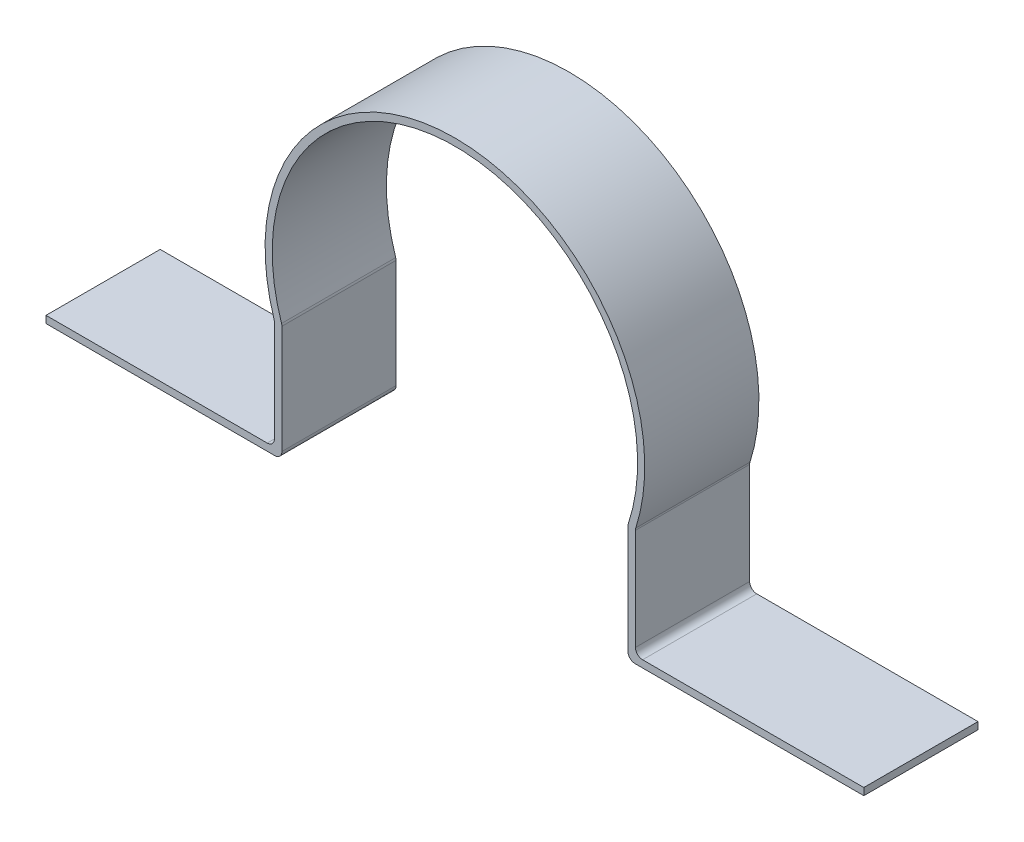
ISO-10303-21;
HEADER;
FILE_DESCRIPTION(('STEP AP214'),'2;1');
FILE_NAME('part.step','',(''),(''),'','','');
FILE_SCHEMA(('AUTOMOTIVE_DESIGN { 1 0 10303 214 1 1 1 1 }'));
ENDSEC;
DATA;
#1=APPLICATION_CONTEXT('core data for automotive mechanical design processes');
#2=APPLICATION_PROTOCOL_DEFINITION('international standard','automotive_design',2000,#1);
#3=PRODUCT_CONTEXT('',#1,'mechanical');
#4=PRODUCT('Part','Part','',(#3));
#5=PRODUCT_RELATED_PRODUCT_CATEGORY('part','',(#4));
#6=PRODUCT_DEFINITION_FORMATION('','',#4);
#7=PRODUCT_DEFINITION_CONTEXT('part definition',#1,'design');
#8=PRODUCT_DEFINITION('design','',#6,#7);
#9=PRODUCT_DEFINITION_SHAPE('','',#8);
#10=(LENGTH_UNIT() NAMED_UNIT(*) SI_UNIT(.MILLI.,.METRE.));
#11=(NAMED_UNIT(*) PLANE_ANGLE_UNIT() SI_UNIT($,.RADIAN.));
#12=(NAMED_UNIT(*) SI_UNIT($,.STERADIAN.) SOLID_ANGLE_UNIT());
#13=UNCERTAINTY_MEASURE_WITH_UNIT(LENGTH_MEASURE(1.E-05),#10,'distance_accuracy_value','');
#14=(GEOMETRIC_REPRESENTATION_CONTEXT(3) GLOBAL_UNCERTAINTY_ASSIGNED_CONTEXT((#13)) GLOBAL_UNIT_ASSIGNED_CONTEXT((#10,
#11,#12)) REPRESENTATION_CONTEXT('',''));
#15=CARTESIAN_POINT('',(0.,0.,0.));
#16=DIRECTION('',(0.,0.,1.));
#17=DIRECTION('',(1.,0.,0.));
#18=AXIS2_PLACEMENT_3D('',#15,#16,#17);
#19=CARTESIAN_POINT('',(20.0804314021882,0.,12.7));
#20=DIRECTION('',(1.,0.,0.));
#21=DIRECTION('',(0.,1.,0.));
#22=AXIS2_PLACEMENT_3D('',#19,#20,#21);
#23=PLANE('',#22);
#24=DIRECTION('',(0.,-1.,0.));
#25=VECTOR('',#24,1.);
#26=CARTESIAN_POINT('',(20.0804314021882,0.,0.));
#27=LINE('',#26,#25);
#28=CARTESIAN_POINT('',(20.0804314021882,-6.64884253374514,0.));
#29=VERTEX_POINT('',#28);
#30=CARTESIAN_POINT('',(20.0804314021883,-17.9225671109713,0.));
#31=VERTEX_POINT('',#30);
#32=EDGE_CURVE('E223',#29,#31,#27,.T.);
#33=ORIENTED_EDGE('',*,*,#32,.F.);
#34=DIRECTION('',(0.,0.,-1.));
#35=VECTOR('',#34,1.);
#36=CARTESIAN_POINT('',(20.0804314021882,-6.64884253374514,12.7));
#37=LINE('',#36,#35);
#38=CARTESIAN_POINT('',(20.0804314021882,-6.64884253374514,12.7));
#39=VERTEX_POINT('',#38);
#40=EDGE_CURVE('E292',#29,#39,#37,.F.);
#41=ORIENTED_EDGE('',*,*,#40,.T.);
#42=DIRECTION('',(0.,-1.,0.));
#43=VECTOR('',#42,1.);
#44=CARTESIAN_POINT('',(20.0804314021882,0.,12.7));
#45=LINE('',#44,#43);
#46=CARTESIAN_POINT('',(20.0804314021883,-17.9225671109713,12.7));
#47=VERTEX_POINT('',#46);
#48=EDGE_CURVE('E253',#39,#47,#45,.T.);
#49=ORIENTED_EDGE('',*,*,#48,.T.);
#50=DIRECTION('',(0.,0.,-1.));
#51=VECTOR('',#50,1.);
#52=CARTESIAN_POINT('',(20.0804314021883,-17.9225671109713,0.));
#53=LINE('',#52,#51);
#54=EDGE_CURVE('E289',#47,#31,#53,.T.);
#55=ORIENTED_EDGE('',*,*,#54,.T.);
#56=EDGE_LOOP('',(#33,#41,#49,#55));
#57=FACE_BOUND('',#56,.T.);
#58=ADVANCED_FACE('F37',(#57),#23,.T.);
#59=CARTESIAN_POINT('',(0.,0.,12.7));
#60=DIRECTION('',(0.,0.,-1.));
#61=DIRECTION('',(-1.,0.,0.));
#62=AXIS2_PLACEMENT_3D('',#59,#60,#61);
#63=CYLINDRICAL_SURFACE('',#62,21.11375);
#64=CARTESIAN_POINT('',(0.,0.,12.7));
#65=DIRECTION('',(0.,0.,1.));
#66=DIRECTION('',(1.,0.,0.));
#67=AXIS2_PLACEMENT_3D('',#64,#65,#66);
#68=CIRCLE('',#67,21.11375);
#69=CARTESIAN_POINT('',(20.1178704818191,-6.40794244194278,12.7));
#70=VERTEX_POINT('',#69);
#71=CARTESIAN_POINT('',(-20.1178704818191,-6.40794244194278,12.7));
#72=VERTEX_POINT('',#71);
#73=EDGE_CURVE('E411',#70,#72,#68,.T.);
#74=ORIENTED_EDGE('',*,*,#73,.F.);
#75=DIRECTION('',(0.,0.,-1.));
#76=VECTOR('',#75,1.);
#77=CARTESIAN_POINT('',(20.1178704818191,-6.40794244194278,12.7));
#78=LINE('',#77,#76);
#79=CARTESIAN_POINT('',(20.1178704818191,-6.40794244194278,0.));
#80=VERTEX_POINT('',#79);
#81=EDGE_CURVE('E286',#70,#80,#78,.T.);
#82=ORIENTED_EDGE('',*,*,#81,.T.);
#83=CARTESIAN_POINT('',(0.,0.,0.));
#84=DIRECTION('',(0.,0.,1.));
#85=DIRECTION('',(1.,0.,0.));
#86=AXIS2_PLACEMENT_3D('',#83,#84,#85);
#87=CIRCLE('',#86,21.11375);
#88=CARTESIAN_POINT('',(-20.1178704818191,-6.40794244194278,0.));
#89=VERTEX_POINT('',#88);
#90=EDGE_CURVE('E226',#80,#89,#87,.T.);
#91=ORIENTED_EDGE('',*,*,#90,.T.);
#92=DIRECTION('',(0.,0.,-1.));
#93=VECTOR('',#92,1.);
#94=CARTESIAN_POINT('',(-20.1178704818191,-6.40794244194278,12.7));
#95=LINE('',#94,#93);
#96=EDGE_CURVE('E284',#89,#72,#95,.F.);
#97=ORIENTED_EDGE('',*,*,#96,.T.);
#98=EDGE_LOOP('',(#74,#82,#91,#97));
#99=FACE_BOUND('',#98,.T.);
#100=ADVANCED_FACE('F341',(#99),#63,.T.);
#101=CARTESIAN_POINT('',(-20.0804314021882,0.,12.7));
#102=DIRECTION('',(1.,0.,0.));
#103=DIRECTION('',(0.,0.,-1.));
#104=AXIS2_PLACEMENT_3D('',#101,#102,#103);
#105=PLANE('',#104);
#106=DIRECTION('',(0.,-1.,0.));
#107=VECTOR('',#106,1.);
#108=CARTESIAN_POINT('',(-20.0804314021882,0.,12.7));
#109=LINE('',#108,#107);
#110=CARTESIAN_POINT('',(-20.0804314021882,-6.64884253374514,12.7));
#111=VERTEX_POINT('',#110);
#112=CARTESIAN_POINT('',(-20.0804314021882,-17.9225671109713,12.7));
#113=VERTEX_POINT('',#112);
#114=EDGE_CURVE('E186',#111,#113,#109,.T.);
#115=ORIENTED_EDGE('',*,*,#114,.F.);
#116=DIRECTION('',(0.,0.,1.));
#117=VECTOR('',#116,1.);
#118=CARTESIAN_POINT('',(-20.0804314021882,-6.64884253374514,0.));
#119=LINE('',#118,#117);
#120=CARTESIAN_POINT('',(-20.0804314021882,-6.64884253374514,0.));
#121=VERTEX_POINT('',#120);
#122=EDGE_CURVE('E307',#111,#121,#119,.F.);
#123=ORIENTED_EDGE('',*,*,#122,.T.);
#124=DIRECTION('',(0.,-1.,0.));
#125=VECTOR('',#124,1.);
#126=CARTESIAN_POINT('',(-20.0804314021882,0.,0.));
#127=LINE('',#126,#125);
#128=CARTESIAN_POINT('',(-20.0804314021882,-17.9225671109713,0.));
#129=VERTEX_POINT('',#128);
#130=EDGE_CURVE('E229',#121,#129,#127,.T.);
#131=ORIENTED_EDGE('',*,*,#130,.T.);
#132=DIRECTION('',(0.,0.,-1.));
#133=VECTOR('',#132,1.);
#134=CARTESIAN_POINT('',(-20.0804314021882,-17.9225671109713,12.7));
#135=LINE('',#134,#133);
#136=EDGE_CURVE('E305',#129,#113,#135,.F.);
#137=ORIENTED_EDGE('',*,*,#136,.T.);
#138=EDGE_LOOP('',(#115,#123,#131,#137));
#139=FACE_BOUND('',#138,.T.);
#140=ADVANCED_FACE('F331',(#139),#105,.F.);
#141=CARTESIAN_POINT('',(0.,-18.7163171109713,12.7));
#142=DIRECTION('',(0.,-1.,0.));
#143=DIRECTION('',(0.,0.,-1.));
#144=AXIS2_PLACEMENT_3D('',#141,#142,#143);
#145=PLANE('',#144);
#146=DIRECTION('',(-1.,0.,0.));
#147=VECTOR('',#146,1.);
#148=CARTESIAN_POINT('',(0.,-18.7163171109713,12.7));
#149=LINE('',#148,#147);
#150=CARTESIAN_POINT('',(-20.8741814021882,-18.7163171109713,12.7));
#151=VERTEX_POINT('',#150);
#152=CARTESIAN_POINT('',(-45.4804314021882,-18.7163171109713,12.7));
#153=VERTEX_POINT('',#152);
#154=EDGE_CURVE('E174',#151,#153,#149,.T.);
#155=ORIENTED_EDGE('',*,*,#154,.F.);
#156=DIRECTION('',(0.,0.,-1.));
#157=VECTOR('',#156,1.);
#158=CARTESIAN_POINT('',(-20.8741814021882,-18.7163171109713,0.));
#159=LINE('',#158,#157);
#160=CARTESIAN_POINT('',(-20.8741814021882,-18.7163171109713,0.));
#161=VERTEX_POINT('',#160);
#162=EDGE_CURVE('E310',#151,#161,#159,.T.);
#163=ORIENTED_EDGE('',*,*,#162,.T.);
#164=DIRECTION('',(-1.,0.,0.));
#165=VECTOR('',#164,1.);
#166=CARTESIAN_POINT('',(0.,-18.7163171109713,0.));
#167=LINE('',#166,#165);
#168=CARTESIAN_POINT('',(-45.4804314021882,-18.7163171109713,0.));
#169=VERTEX_POINT('',#168);
#170=EDGE_CURVE('E192',#161,#169,#167,.T.);
#171=ORIENTED_EDGE('',*,*,#170,.T.);
#172=DIRECTION('',(0.,0.,-1.));
#173=VECTOR('',#172,1.);
#174=CARTESIAN_POINT('',(-45.4804314021882,-18.7163171109713,12.7));
#175=LINE('',#174,#173);
#176=EDGE_CURVE('E189',#153,#169,#175,.T.);
#177=ORIENTED_EDGE('',*,*,#176,.F.);
#178=EDGE_LOOP('',(#155,#163,#171,#177));
#179=FACE_BOUND('',#178,.T.);
#180=ADVANCED_FACE('F190',(#179),#145,.F.);
#181=CARTESIAN_POINT('',(-45.4804314021884,-3.9758600088657E-13,12.7));
#182=DIRECTION('',(-1.,0.,0.));
#183=DIRECTION('',(0.,-1.,0.));
#184=AXIS2_PLACEMENT_3D('',#181,#182,#183);
#185=PLANE('',#184);
#186=DIRECTION('',(0.,1.,0.));
#187=VECTOR('',#186,1.);
#188=CARTESIAN_POINT('',(-45.4804314021884,-3.9758600088657E-13,0.));
#189=LINE('',#188,#187);
#190=CARTESIAN_POINT('',(-45.4804314021882,-19.5100671109713,0.));
#191=VERTEX_POINT('',#190);
#192=EDGE_CURVE('E233',#191,#169,#189,.T.);
#193=ORIENTED_EDGE('',*,*,#192,.F.);
#194=DIRECTION('',(0.,0.,-1.));
#195=VECTOR('',#194,1.);
#196=CARTESIAN_POINT('',(-45.4804314021882,-19.5100671109713,12.7));
#197=LINE('',#196,#195);
#198=CARTESIAN_POINT('',(-45.4804314021882,-19.5100671109713,12.7));
#199=VERTEX_POINT('',#198);
#200=EDGE_CURVE('E197',#199,#191,#197,.T.);
#201=ORIENTED_EDGE('',*,*,#200,.F.);
#202=DIRECTION('',(0.,1.,0.));
#203=VECTOR('',#202,1.);
#204=CARTESIAN_POINT('',(-45.4804314021884,-3.9758600088657E-13,12.7));
#205=LINE('',#204,#203);
#206=EDGE_CURVE('E180',#199,#153,#205,.T.);
#207=ORIENTED_EDGE('',*,*,#206,.T.);
#208=ORIENTED_EDGE('',*,*,#176,.T.);
#209=EDGE_LOOP('',(#193,#201,#207,#208));
#210=FACE_BOUND('',#209,.T.);
#211=ADVANCED_FACE('F200',(#210),#185,.T.);
#212=CARTESIAN_POINT('',(0.,-19.5100671109713,12.7));
#213=DIRECTION('',(0.,-1.,0.));
#214=DIRECTION('',(1.,0.,0.));
#215=AXIS2_PLACEMENT_3D('',#212,#213,#214);
#216=PLANE('',#215);
#217=DIRECTION('',(-1.,0.,0.));
#218=VECTOR('',#217,1.);
#219=CARTESIAN_POINT('',(0.,-19.5100671109713,0.));
#220=LINE('',#219,#218);
#221=CARTESIAN_POINT('',(-20.0378578316322,-19.5100671109713,0.));
#222=VERTEX_POINT('',#221);
#223=EDGE_CURVE('E235',#222,#191,#220,.T.);
#224=ORIENTED_EDGE('',*,*,#223,.F.);
#225=DIRECTION('',(0.,0.,-1.));
#226=VECTOR('',#225,1.);
#227=CARTESIAN_POINT('',(-20.0378578316322,-19.5100671109713,12.7));
#228=LINE('',#227,#226);
#229=CARTESIAN_POINT('',(-20.0378578316322,-19.5100671109713,12.7));
#230=VERTEX_POINT('',#229);
#231=EDGE_CURVE('E303',#222,#230,#228,.F.);
#232=ORIENTED_EDGE('',*,*,#231,.T.);
#233=DIRECTION('',(-1.,0.,0.));
#234=VECTOR('',#233,1.);
#235=CARTESIAN_POINT('',(0.,-19.5100671109713,12.7));
#236=LINE('',#235,#234);
#237=EDGE_CURVE('E202',#230,#199,#236,.T.);
#238=ORIENTED_EDGE('',*,*,#237,.T.);
#239=ORIENTED_EDGE('',*,*,#200,.T.);
#240=EDGE_LOOP('',(#224,#232,#238,#239));
#241=FACE_BOUND('',#240,.T.);
#242=ADVANCED_FACE('F435',(#241),#216,.T.);
#243=CARTESIAN_POINT('',(-19.2441078316322,0.,12.7));
#244=DIRECTION('',(1.,0.,0.));
#245=DIRECTION('',(0.,0.,-1.));
#246=AXIS2_PLACEMENT_3D('',#243,#244,#245);
#247=PLANE('',#246);
#248=DIRECTION('',(0.,-1.,0.));
#249=VECTOR('',#248,1.);
#250=CARTESIAN_POINT('',(-19.2441078316322,0.,12.7));
#251=LINE('',#250,#249);
#252=CARTESIAN_POINT('',(-19.2441078316322,-6.6539230970756,12.7));
#253=VERTEX_POINT('',#252);
#254=CARTESIAN_POINT('',(-19.2441078316322,-18.7163171109713,12.7));
#255=VERTEX_POINT('',#254);
#256=EDGE_CURVE('E204',#253,#255,#251,.T.);
#257=ORIENTED_EDGE('',*,*,#256,.T.);
#258=DIRECTION('',(0.,0.,-1.));
#259=VECTOR('',#258,1.);
#260=CARTESIAN_POINT('',(-19.2441078316322,-18.7163171109713,12.7));
#261=LINE('',#260,#259);
#262=CARTESIAN_POINT('',(-19.2441078316322,-18.7163171109713,0.));
#263=VERTEX_POINT('',#262);
#264=EDGE_CURVE('E300',#255,#263,#261,.T.);
#265=ORIENTED_EDGE('',*,*,#264,.T.);
#266=DIRECTION('',(0.,-1.,0.));
#267=VECTOR('',#266,1.);
#268=CARTESIAN_POINT('',(-19.2441078316322,0.,0.));
#269=LINE('',#268,#267);
#270=CARTESIAN_POINT('',(-19.2441078316322,-6.6539230970756,0.));
#271=VERTEX_POINT('',#270);
#272=EDGE_CURVE('E237',#271,#263,#269,.T.);
#273=ORIENTED_EDGE('',*,*,#272,.F.);
#274=DIRECTION('',(0.,0.,-1.));
#275=VECTOR('',#274,1.);
#276=CARTESIAN_POINT('',(-19.2441078316322,-6.6539230970756,12.7));
#277=LINE('',#276,#275);
#278=EDGE_CURVE('E298',#271,#253,#277,.F.);
#279=ORIENTED_EDGE('',*,*,#278,.T.);
#280=EDGE_LOOP('',(#257,#265,#273,#279));
#281=FACE_BOUND('',#280,.T.);
#282=ADVANCED_FACE('F432',(#281),#247,.T.);
#283=CARTESIAN_POINT('',(0.,0.,12.7));
#284=DIRECTION('',(0.,0.,-1.));
#285=DIRECTION('',(-1.,0.,0.));
#286=AXIS2_PLACEMENT_3D('',#283,#284,#285);
#287=CYLINDRICAL_SURFACE('',#286,20.32);
#288=CARTESIAN_POINT('',(0.,0.,0.));
#289=DIRECTION('',(0.,0.,1.));
#290=DIRECTION('',(1.,0.,0.));
#291=AXIS2_PLACEMENT_3D('',#288,#289,#290);
#292=CIRCLE('',#291,20.32);
#293=CARTESIAN_POINT('',(19.284554905631,-6.40377561222313,0.));
#294=VERTEX_POINT('',#293);
#295=CARTESIAN_POINT('',(-19.284554905631,-6.40377561222313,0.));
#296=VERTEX_POINT('',#295);
#297=EDGE_CURVE('E240',#294,#296,#292,.T.);
#298=ORIENTED_EDGE('',*,*,#297,.F.);
#299=DIRECTION('',(0.,0.,-1.));
#300=VECTOR('',#299,1.);
#301=CARTESIAN_POINT('',(19.284554905631,-6.40377561222313,12.7));
#302=LINE('',#301,#300);
#303=CARTESIAN_POINT('',(19.284554905631,-6.40377561222313,12.7));
#304=VERTEX_POINT('',#303);
#305=EDGE_CURVE('E275',#294,#304,#302,.F.);
#306=ORIENTED_EDGE('',*,*,#305,.T.);
#307=CARTESIAN_POINT('',(0.,0.,12.7));
#308=DIRECTION('',(0.,0.,1.));
#309=DIRECTION('',(1.,0.,0.));
#310=AXIS2_PLACEMENT_3D('',#307,#308,#309);
#311=CIRCLE('',#310,20.32);
#312=CARTESIAN_POINT('',(-19.284554905631,-6.40377561222313,12.7));
#313=VERTEX_POINT('',#312);
#314=EDGE_CURVE('E210',#304,#313,#311,.T.);
#315=ORIENTED_EDGE('',*,*,#314,.T.);
#316=DIRECTION('',(0.,0.,-1.));
#317=VECTOR('',#316,1.);
#318=CARTESIAN_POINT('',(-19.284554905631,-6.40377561222314,12.7));
#319=LINE('',#318,#317);
#320=EDGE_CURVE('E272',#313,#296,#319,.T.);
#321=ORIENTED_EDGE('',*,*,#320,.T.);
#322=EDGE_LOOP('',(#298,#306,#315,#321));
#323=FACE_BOUND('',#322,.T.);
#324=ADVANCED_FACE('F383',(#323),#287,.F.);
#325=CARTESIAN_POINT('',(19.2441078316322,0.,12.7));
#326=DIRECTION('',(1.,0.,0.));
#327=DIRECTION('',(0.,1.,0.));
#328=AXIS2_PLACEMENT_3D('',#325,#326,#327);
#329=PLANE('',#328);
#330=DIRECTION('',(0.,-1.,0.));
#331=VECTOR('',#330,1.);
#332=CARTESIAN_POINT('',(19.2441078316322,0.,12.7));
#333=LINE('',#332,#331);
#334=CARTESIAN_POINT('',(19.2441078316322,-6.6539230970756,12.7));
#335=VERTEX_POINT('',#334);
#336=CARTESIAN_POINT('',(19.2441078316322,-18.7163171109713,12.7));
#337=VERTEX_POINT('',#336);
#338=EDGE_CURVE('E213',#335,#337,#333,.T.);
#339=ORIENTED_EDGE('',*,*,#338,.F.);
#340=DIRECTION('',(0.,0.,1.));
#341=VECTOR('',#340,1.);
#342=CARTESIAN_POINT('',(19.2441078316322,-6.6539230970756,0.));
#343=LINE('',#342,#341);
#344=CARTESIAN_POINT('',(19.2441078316322,-6.6539230970756,0.));
#345=VERTEX_POINT('',#344);
#346=EDGE_CURVE('E261',#335,#345,#343,.F.);
#347=ORIENTED_EDGE('',*,*,#346,.T.);
#348=DIRECTION('',(0.,-1.,0.));
#349=VECTOR('',#348,1.);
#350=CARTESIAN_POINT('',(19.2441078316322,0.,0.));
#351=LINE('',#350,#349);
#352=CARTESIAN_POINT('',(19.2441078316322,-18.7163171109713,0.));
#353=VERTEX_POINT('',#352);
#354=EDGE_CURVE('E243',#345,#353,#351,.T.);
#355=ORIENTED_EDGE('',*,*,#354,.T.);
#356=DIRECTION('',(0.,0.,-1.));
#357=VECTOR('',#356,1.);
#358=CARTESIAN_POINT('',(19.2441078316322,-18.7163171109713,12.7));
#359=LINE('',#358,#357);
#360=EDGE_CURVE('E196',#353,#337,#359,.F.);
#361=ORIENTED_EDGE('',*,*,#360,.T.);
#362=EDGE_LOOP('',(#339,#347,#355,#361));
#363=FACE_BOUND('',#362,.T.);
#364=ADVANCED_FACE('F388',(#363),#329,.F.);
#365=CARTESIAN_POINT('',(0.,-19.5100671109713,12.7));
#366=DIRECTION('',(0.,1.,0.));
#367=DIRECTION('',(-1.,0.,0.));
#368=AXIS2_PLACEMENT_3D('',#365,#366,#367);
#369=PLANE('',#368);
#370=DIRECTION('',(1.,0.,0.));
#371=VECTOR('',#370,1.);
#372=CARTESIAN_POINT('',(0.,-19.5100671109713,12.7));
#373=LINE('',#372,#371);
#374=CARTESIAN_POINT('',(20.0378578316322,-19.5100671109713,12.7));
#375=VERTEX_POINT('',#374);
#376=CARTESIAN_POINT('',(45.4804314021883,-19.5100671109712,12.7));
#377=VERTEX_POINT('',#376);
#378=EDGE_CURVE('E215',#375,#377,#373,.T.);
#379=ORIENTED_EDGE('',*,*,#378,.F.);
#380=DIRECTION('',(0.,0.,-1.));
#381=VECTOR('',#380,1.);
#382=CARTESIAN_POINT('',(20.0378578316322,-19.5100671109713,12.7));
#383=LINE('',#382,#381);
#384=CARTESIAN_POINT('',(20.0378578316322,-19.5100671109713,0.));
#385=VERTEX_POINT('',#384);
#386=EDGE_CURVE('E295',#375,#385,#383,.T.);
#387=ORIENTED_EDGE('',*,*,#386,.T.);
#388=DIRECTION('',(1.,0.,0.));
#389=VECTOR('',#388,1.);
#390=CARTESIAN_POINT('',(0.,-19.5100671109713,0.));
#391=LINE('',#390,#389);
#392=CARTESIAN_POINT('',(45.4804314021883,-19.5100671109712,0.));
#393=VERTEX_POINT('',#392);
#394=EDGE_CURVE('E246',#385,#393,#391,.T.);
#395=ORIENTED_EDGE('',*,*,#394,.T.);
#396=DIRECTION('',(0.,0.,-1.));
#397=VECTOR('',#396,1.);
#398=CARTESIAN_POINT('',(45.4804314021883,-19.5100671109712,12.7));
#399=LINE('',#398,#397);
#400=EDGE_CURVE('E256',#377,#393,#399,.T.);
#401=ORIENTED_EDGE('',*,*,#400,.F.);
#402=EDGE_LOOP('',(#379,#387,#395,#401));
#403=FACE_BOUND('',#402,.T.);
#404=ADVANCED_FACE('F393',(#403),#369,.F.);
#405=CARTESIAN_POINT('',(45.4804314021884,-3.9758600088657E-13,12.7));
#406=DIRECTION('',(-1.,0.,0.));
#407=DIRECTION('',(0.,-1.,0.));
#408=AXIS2_PLACEMENT_3D('',#405,#406,#407);
#409=PLANE('',#408);
#410=DIRECTION('',(0.,1.,0.));
#411=VECTOR('',#410,1.);
#412=CARTESIAN_POINT('',(45.4804314021884,-3.9758600088657E-13,0.));
#413=LINE('',#412,#411);
#414=CARTESIAN_POINT('',(45.4804314021883,-18.7163171109712,0.));
#415=VERTEX_POINT('',#414);
#416=EDGE_CURVE('E248',#393,#415,#413,.T.);
#417=ORIENTED_EDGE('',*,*,#416,.T.);
#418=DIRECTION('',(0.,0.,-1.));
#419=VECTOR('',#418,1.);
#420=CARTESIAN_POINT('',(45.4804314021883,-18.7163171109712,12.7));
#421=LINE('',#420,#419);
#422=CARTESIAN_POINT('',(45.4804314021883,-18.7163171109712,12.7));
#423=VERTEX_POINT('',#422);
#424=EDGE_CURVE('E222',#423,#415,#421,.T.);
#425=ORIENTED_EDGE('',*,*,#424,.F.);
#426=DIRECTION('',(0.,1.,0.));
#427=VECTOR('',#426,1.);
#428=CARTESIAN_POINT('',(45.4804314021884,-3.9758600088657E-13,12.7));
#429=LINE('',#428,#427);
#430=EDGE_CURVE('E217',#377,#423,#429,.T.);
#431=ORIENTED_EDGE('',*,*,#430,.F.);
#432=ORIENTED_EDGE('',*,*,#400,.T.);
#433=EDGE_LOOP('',(#417,#425,#431,#432));
#434=FACE_BOUND('',#433,.T.);
#435=ADVANCED_FACE('F398',(#434),#409,.F.);
#436=CARTESIAN_POINT('',(0.,-18.7163171109713,12.7));
#437=DIRECTION('',(0.,1.,0.));
#438=DIRECTION('',(-1.,0.,0.));
#439=AXIS2_PLACEMENT_3D('',#436,#437,#438);
#440=PLANE('',#439);
#441=DIRECTION('',(1.,0.,0.));
#442=VECTOR('',#441,1.);
#443=CARTESIAN_POINT('',(0.,-18.7163171109713,0.));
#444=LINE('',#443,#442);
#445=CARTESIAN_POINT('',(20.8741814021883,-18.7163171109713,0.));
#446=VERTEX_POINT('',#445);
#447=EDGE_CURVE('E251',#446,#415,#444,.T.);
#448=ORIENTED_EDGE('',*,*,#447,.F.);
#449=DIRECTION('',(0.,0.,-1.));
#450=VECTOR('',#449,1.);
#451=CARTESIAN_POINT('',(20.8741814021883,-18.7163171109713,12.7));
#452=LINE('',#451,#450);
#453=CARTESIAN_POINT('',(20.8741814021883,-18.7163171109713,12.7));
#454=VERTEX_POINT('',#453);
#455=EDGE_CURVE('E52',#446,#454,#452,.F.);
#456=ORIENTED_EDGE('',*,*,#455,.T.);
#457=DIRECTION('',(1.,0.,0.));
#458=VECTOR('',#457,1.);
#459=CARTESIAN_POINT('',(0.,-18.7163171109713,12.7));
#460=LINE('',#459,#458);
#461=EDGE_CURVE('E220',#454,#423,#460,.T.);
#462=ORIENTED_EDGE('',*,*,#461,.T.);
#463=ORIENTED_EDGE('',*,*,#424,.T.);
#464=EDGE_LOOP('',(#448,#456,#462,#463));
#465=FACE_BOUND('',#464,.T.);
#466=ADVANCED_FACE('F415',(#465),#440,.T.);
#467=CARTESIAN_POINT('',(0.,0.,12.7));
#468=DIRECTION('',(0.,0.,1.));
#469=DIRECTION('',(1.,0.,0.));
#470=AXIS2_PLACEMENT_3D('',#467,#468,#469);
#471=PLANE('',#470);
#472=ORIENTED_EDGE('',*,*,#314,.F.);
#473=CARTESIAN_POINT('',(20.0378578316322,-6.6539230970756,12.7));
#474=DIRECTION('',(0.,0.,1.));
#475=DIRECTION('',(1.,0.,0.));
#476=AXIS2_PLACEMENT_3D('',#473,#474,#475);
#477=CIRCLE('',#476,0.79375);
#478=EDGE_CURVE('E282',#304,#335,#477,.T.);
#479=ORIENTED_EDGE('',*,*,#478,.T.);
#480=ORIENTED_EDGE('',*,*,#338,.T.);
#481=CARTESIAN_POINT('',(20.0378578316322,-18.7163171109713,12.7));
#482=DIRECTION('',(0.,0.,1.));
#483=DIRECTION('',(1.,0.,0.));
#484=AXIS2_PLACEMENT_3D('',#481,#482,#483);
#485=CIRCLE('',#484,0.79375);
#486=EDGE_CURVE('E60',#337,#375,#485,.T.);
#487=ORIENTED_EDGE('',*,*,#486,.T.);
#488=ORIENTED_EDGE('',*,*,#378,.T.);
#489=ORIENTED_EDGE('',*,*,#430,.T.);
#490=ORIENTED_EDGE('',*,*,#461,.F.);
#491=CARTESIAN_POINT('',(20.8741814021883,-17.9225671109713,12.7));
#492=DIRECTION('',(0.,0.,1.));
#493=DIRECTION('',(1.,0.,0.));
#494=AXIS2_PLACEMENT_3D('',#491,#492,#493);
#495=CIRCLE('',#494,0.79375);
#496=EDGE_CURVE('E318',#454,#47,#495,.F.);
#497=ORIENTED_EDGE('',*,*,#496,.T.);
#498=ORIENTED_EDGE('',*,*,#48,.F.);
#499=CARTESIAN_POINT('',(20.8741814021882,-6.64884253374514,12.7));
#500=DIRECTION('',(0.,0.,1.));
#501=DIRECTION('',(1.,0.,0.));
#502=AXIS2_PLACEMENT_3D('',#499,#500,#501);
#503=CIRCLE('',#502,0.79375);
#504=EDGE_CURVE('E314',#39,#70,#503,.F.);
#505=ORIENTED_EDGE('',*,*,#504,.T.);
#506=ORIENTED_EDGE('',*,*,#73,.T.);
#507=CARTESIAN_POINT('',(-20.8741814021882,-6.64884253374514,12.7));
#508=DIRECTION('',(0.,0.,1.));
#509=DIRECTION('',(1.,0.,0.));
#510=AXIS2_PLACEMENT_3D('',#507,#508,#509);
#511=CIRCLE('',#510,0.79375);
#512=EDGE_CURVE('E322',#72,#111,#511,.F.);
#513=ORIENTED_EDGE('',*,*,#512,.T.);
#514=ORIENTED_EDGE('',*,*,#114,.T.);
#515=CARTESIAN_POINT('',(-20.8741814021882,-17.9225671109713,12.7));
#516=DIRECTION('',(0.,0.,1.));
#517=DIRECTION('',(1.,0.,0.));
#518=AXIS2_PLACEMENT_3D('',#515,#516,#517);
#519=CIRCLE('',#518,0.79375);
#520=EDGE_CURVE('E11',#113,#151,#519,.F.);
#521=ORIENTED_EDGE('',*,*,#520,.T.);
#522=ORIENTED_EDGE('',*,*,#154,.T.);
#523=ORIENTED_EDGE('',*,*,#206,.F.);
#524=ORIENTED_EDGE('',*,*,#237,.F.);
#525=CARTESIAN_POINT('',(-20.0378578316322,-18.7163171109713,12.7));
#526=DIRECTION('',(0.,0.,1.));
#527=DIRECTION('',(1.,0.,0.));
#528=AXIS2_PLACEMENT_3D('',#525,#526,#527);
#529=CIRCLE('',#528,0.79375);
#530=EDGE_CURVE('E279',#230,#255,#529,.T.);
#531=ORIENTED_EDGE('',*,*,#530,.T.);
#532=ORIENTED_EDGE('',*,*,#256,.F.);
#533=CARTESIAN_POINT('',(-20.0378578316322,-6.6539230970756,12.7));
#534=DIRECTION('',(0.,0.,1.));
#535=DIRECTION('',(1.,0.,0.));
#536=AXIS2_PLACEMENT_3D('',#533,#534,#535);
#537=CIRCLE('',#536,0.79375);
#538=EDGE_CURVE('E277',#253,#313,#537,.T.);
#539=ORIENTED_EDGE('',*,*,#538,.T.);
#540=EDGE_LOOP('',(#472,#479,#480,#487,#488,#489,#490,#497,#498,#505,#506,#513,#514,#521,#522,
#523,#524,#531,#532,#539));
#541=FACE_BOUND('',#540,.T.);
#542=ADVANCED_FACE('F177',(#541),#471,.T.);
#543=CARTESIAN_POINT('',(0.,0.,0.));
#544=DIRECTION('',(0.,0.,1.));
#545=DIRECTION('',(1.,0.,0.));
#546=AXIS2_PLACEMENT_3D('',#543,#544,#545);
#547=PLANE('',#546);
#548=ORIENTED_EDGE('',*,*,#354,.F.);
#549=CARTESIAN_POINT('',(20.0378578316322,-6.6539230970756,0.));
#550=DIRECTION('',(0.,0.,1.));
#551=DIRECTION('',(1.,0.,0.));
#552=AXIS2_PLACEMENT_3D('',#549,#550,#551);
#553=CIRCLE('',#552,0.79375);
#554=EDGE_CURVE('E270',#345,#294,#553,.F.);
#555=ORIENTED_EDGE('',*,*,#554,.T.);
#556=ORIENTED_EDGE('',*,*,#297,.T.);
#557=CARTESIAN_POINT('',(-20.0378578316322,-6.6539230970756,0.));
#558=DIRECTION('',(0.,0.,1.));
#559=DIRECTION('',(1.,0.,0.));
#560=AXIS2_PLACEMENT_3D('',#557,#558,#559);
#561=CIRCLE('',#560,0.79375);
#562=EDGE_CURVE('E264',#296,#271,#561,.F.);
#563=ORIENTED_EDGE('',*,*,#562,.T.);
#564=ORIENTED_EDGE('',*,*,#272,.T.);
#565=CARTESIAN_POINT('',(-20.0378578316322,-18.7163171109713,0.));
#566=DIRECTION('',(0.,0.,1.));
#567=DIRECTION('',(1.,0.,0.));
#568=AXIS2_PLACEMENT_3D('',#565,#566,#567);
#569=CIRCLE('',#568,0.79375);
#570=EDGE_CURVE('E266',#263,#222,#569,.F.);
#571=ORIENTED_EDGE('',*,*,#570,.T.);
#572=ORIENTED_EDGE('',*,*,#223,.T.);
#573=ORIENTED_EDGE('',*,*,#192,.T.);
#574=ORIENTED_EDGE('',*,*,#170,.F.);
#575=CARTESIAN_POINT('',(-20.8741814021882,-17.9225671109713,0.));
#576=DIRECTION('',(0.,0.,1.));
#577=DIRECTION('',(1.,0.,0.));
#578=AXIS2_PLACEMENT_3D('',#575,#576,#577);
#579=CIRCLE('',#578,0.79375);
#580=EDGE_CURVE('E45',#161,#129,#579,.T.);
#581=ORIENTED_EDGE('',*,*,#580,.T.);
#582=ORIENTED_EDGE('',*,*,#130,.F.);
#583=CARTESIAN_POINT('',(-20.8741814021882,-6.64884253374514,0.));
#584=DIRECTION('',(0.,0.,1.));
#585=DIRECTION('',(1.,0.,0.));
#586=AXIS2_PLACEMENT_3D('',#583,#584,#585);
#587=CIRCLE('',#586,0.79375);
#588=EDGE_CURVE('E320',#121,#89,#587,.T.);
#589=ORIENTED_EDGE('',*,*,#588,.T.);
#590=ORIENTED_EDGE('',*,*,#90,.F.);
#591=CARTESIAN_POINT('',(20.8741814021882,-6.64884253374514,0.));
#592=DIRECTION('',(0.,0.,1.));
#593=DIRECTION('',(1.,0.,0.));
#594=AXIS2_PLACEMENT_3D('',#591,#592,#593);
#595=CIRCLE('',#594,0.79375);
#596=EDGE_CURVE('E312',#80,#29,#595,.T.);
#597=ORIENTED_EDGE('',*,*,#596,.T.);
#598=ORIENTED_EDGE('',*,*,#32,.T.);
#599=CARTESIAN_POINT('',(20.8741814021883,-17.9225671109713,0.));
#600=DIRECTION('',(0.,0.,1.));
#601=DIRECTION('',(1.,0.,0.));
#602=AXIS2_PLACEMENT_3D('',#599,#600,#601);
#603=CIRCLE('',#602,0.79375);
#604=EDGE_CURVE('E316',#31,#446,#603,.T.);
#605=ORIENTED_EDGE('',*,*,#604,.T.);
#606=ORIENTED_EDGE('',*,*,#447,.T.);
#607=ORIENTED_EDGE('',*,*,#416,.F.);
#608=ORIENTED_EDGE('',*,*,#394,.F.);
#609=CARTESIAN_POINT('',(20.0378578316322,-18.7163171109713,0.));
#610=DIRECTION('',(0.,0.,1.));
#611=DIRECTION('',(1.,0.,0.));
#612=AXIS2_PLACEMENT_3D('',#609,#610,#611);
#613=CIRCLE('',#612,0.79375);
#614=EDGE_CURVE('E268',#385,#353,#613,.F.);
#615=ORIENTED_EDGE('',*,*,#614,.T.);
#616=EDGE_LOOP('',(#548,#555,#556,#563,#564,#571,#572,#573,#574,#581,#582,#589,#590,#597,#598,
#605,#606,#607,#608,#615));
#617=FACE_BOUND('',#616,.T.);
#618=ADVANCED_FACE('F326',(#617),#547,.F.);
#619=CARTESIAN_POINT('',(20.0378578316322,-6.6539230970756,12.7));
#620=DIRECTION('',(0.,0.,-1.));
#621=DIRECTION('',(-1.,0.,0.));
#622=AXIS2_PLACEMENT_3D('',#619,#620,#621);
#623=CYLINDRICAL_SURFACE('',#622,0.79375);
#624=ORIENTED_EDGE('',*,*,#478,.F.);
#625=ORIENTED_EDGE('',*,*,#305,.F.);
#626=ORIENTED_EDGE('',*,*,#554,.F.);
#627=ORIENTED_EDGE('',*,*,#346,.F.);
#628=EDGE_LOOP('',(#624,#625,#626,#627));
#629=FACE_BOUND('',#628,.T.);
#630=ADVANCED_FACE('F352',(#629),#623,.T.);
#631=CARTESIAN_POINT('',(20.8741814021882,-6.64884253374514,12.7));
#632=DIRECTION('',(0.,0.,-1.));
#633=DIRECTION('',(-1.,0.,0.));
#634=AXIS2_PLACEMENT_3D('',#631,#632,#633);
#635=CYLINDRICAL_SURFACE('',#634,0.79375);
#636=ORIENTED_EDGE('',*,*,#504,.F.);
#637=ORIENTED_EDGE('',*,*,#40,.F.);
#638=ORIENTED_EDGE('',*,*,#596,.F.);
#639=ORIENTED_EDGE('',*,*,#81,.F.);
#640=EDGE_LOOP('',(#636,#637,#638,#639));
#641=FACE_BOUND('',#640,.T.);
#642=ADVANCED_FACE('F355',(#641),#635,.F.);
#643=CARTESIAN_POINT('',(20.8741814021883,-17.9225671109713,12.7));
#644=DIRECTION('',(0.,0.,1.));
#645=DIRECTION('',(1.,0.,0.));
#646=AXIS2_PLACEMENT_3D('',#643,#644,#645);
#647=CYLINDRICAL_SURFACE('',#646,0.79375);
#648=ORIENTED_EDGE('',*,*,#496,.F.);
#649=ORIENTED_EDGE('',*,*,#455,.F.);
#650=ORIENTED_EDGE('',*,*,#604,.F.);
#651=ORIENTED_EDGE('',*,*,#54,.F.);
#652=EDGE_LOOP('',(#648,#649,#650,#651));
#653=FACE_BOUND('',#652,.T.);
#654=ADVANCED_FACE('F359',(#653),#647,.F.);
#655=CARTESIAN_POINT('',(20.0378578316322,-18.7163171109713,12.7));
#656=DIRECTION('',(0.,0.,-1.));
#657=DIRECTION('',(-1.,0.,0.));
#658=AXIS2_PLACEMENT_3D('',#655,#656,#657);
#659=CYLINDRICAL_SURFACE('',#658,0.79375);
#660=ORIENTED_EDGE('',*,*,#486,.F.);
#661=ORIENTED_EDGE('',*,*,#360,.F.);
#662=ORIENTED_EDGE('',*,*,#614,.F.);
#663=ORIENTED_EDGE('',*,*,#386,.F.);
#664=EDGE_LOOP('',(#660,#661,#662,#663));
#665=FACE_BOUND('',#664,.T.);
#666=ADVANCED_FACE('F363',(#665),#659,.T.);
#667=CARTESIAN_POINT('',(-20.0378578316322,-18.7163171109713,12.7));
#668=DIRECTION('',(0.,0.,-1.));
#669=DIRECTION('',(-1.,0.,0.));
#670=AXIS2_PLACEMENT_3D('',#667,#668,#669);
#671=CYLINDRICAL_SURFACE('',#670,0.79375);
#672=ORIENTED_EDGE('',*,*,#530,.F.);
#673=ORIENTED_EDGE('',*,*,#231,.F.);
#674=ORIENTED_EDGE('',*,*,#570,.F.);
#675=ORIENTED_EDGE('',*,*,#264,.F.);
#676=EDGE_LOOP('',(#672,#673,#674,#675));
#677=FACE_BOUND('',#676,.T.);
#678=ADVANCED_FACE('F367',(#677),#671,.T.);
#679=CARTESIAN_POINT('',(-20.0378578316322,-6.6539230970756,12.7));
#680=DIRECTION('',(0.,0.,-1.));
#681=DIRECTION('',(-1.,0.,0.));
#682=AXIS2_PLACEMENT_3D('',#679,#680,#681);
#683=CYLINDRICAL_SURFACE('',#682,0.79375);
#684=ORIENTED_EDGE('',*,*,#538,.F.);
#685=ORIENTED_EDGE('',*,*,#278,.F.);
#686=ORIENTED_EDGE('',*,*,#562,.F.);
#687=ORIENTED_EDGE('',*,*,#320,.F.);
#688=EDGE_LOOP('',(#684,#685,#686,#687));
#689=FACE_BOUND('',#688,.T.);
#690=ADVANCED_FACE('F338',(#689),#683,.T.);
#691=CARTESIAN_POINT('',(-20.8741814021882,-6.64884253374514,12.7));
#692=DIRECTION('',(0.,0.,-1.));
#693=DIRECTION('',(-1.,0.,0.));
#694=AXIS2_PLACEMENT_3D('',#691,#692,#693);
#695=CYLINDRICAL_SURFACE('',#694,0.79375);
#696=ORIENTED_EDGE('',*,*,#512,.F.);
#697=ORIENTED_EDGE('',*,*,#96,.F.);
#698=ORIENTED_EDGE('',*,*,#588,.F.);
#699=ORIENTED_EDGE('',*,*,#122,.F.);
#700=EDGE_LOOP('',(#696,#697,#698,#699));
#701=FACE_BOUND('',#700,.T.);
#702=ADVANCED_FACE('F334',(#701),#695,.F.);
#703=CARTESIAN_POINT('',(-20.8741814021882,-17.9225671109713,12.7));
#704=DIRECTION('',(0.,0.,1.));
#705=DIRECTION('',(1.,0.,0.));
#706=AXIS2_PLACEMENT_3D('',#703,#704,#705);
#707=CYLINDRICAL_SURFACE('',#706,0.79375);
#708=ORIENTED_EDGE('',*,*,#520,.F.);
#709=ORIENTED_EDGE('',*,*,#136,.F.);
#710=ORIENTED_EDGE('',*,*,#580,.F.);
#711=ORIENTED_EDGE('',*,*,#162,.F.);
#712=EDGE_LOOP('',(#708,#709,#710,#711));
#713=FACE_BOUND('',#712,.T.);
#714=ADVANCED_FACE('F39',(#713),#707,.F.);
#715=CLOSED_SHELL('',(#58,#100,#140,#180,#211,#242,#282,#324,#364,#404,#435,#466,#542,#618,#630,
#642,#654,#666,#678,#690,#702,#714));
#716=MANIFOLD_SOLID_BREP('B2',#715);
#717=ADVANCED_BREP_SHAPE_REPRESENTATION('',(#18,#716),#14);
#718=SHAPE_DEFINITION_REPRESENTATION(#9,#717);
ENDSEC;
END-ISO-10303-21;
